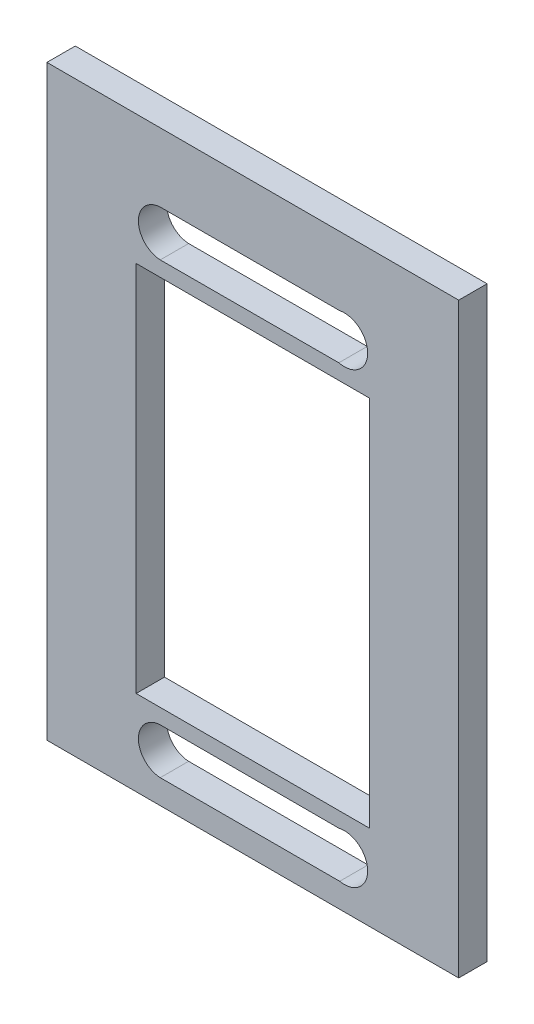
ISO-10303-21;
HEADER;
FILE_DESCRIPTION(('STEP AP214'),'2;1');
FILE_NAME('part.step','',(''),(''),'','','');
FILE_SCHEMA(('AUTOMOTIVE_DESIGN { 1 0 10303 214 1 1 1 1 }'));
ENDSEC;
DATA;
#1=APPLICATION_CONTEXT('core data for automotive mechanical design processes');
#2=APPLICATION_PROTOCOL_DEFINITION('international standard','automotive_design',2000,#1);
#3=PRODUCT_CONTEXT('',#1,'mechanical');
#4=PRODUCT('Part','Part','',(#3));
#5=PRODUCT_RELATED_PRODUCT_CATEGORY('part','',(#4));
#6=PRODUCT_DEFINITION_FORMATION('','',#4);
#7=PRODUCT_DEFINITION_CONTEXT('part definition',#1,'design');
#8=PRODUCT_DEFINITION('design','',#6,#7);
#9=PRODUCT_DEFINITION_SHAPE('','',#8);
#10=(LENGTH_UNIT() NAMED_UNIT(*) SI_UNIT(.MILLI.,.METRE.));
#11=(NAMED_UNIT(*) PLANE_ANGLE_UNIT() SI_UNIT($,.RADIAN.));
#12=(NAMED_UNIT(*) SI_UNIT($,.STERADIAN.) SOLID_ANGLE_UNIT());
#13=UNCERTAINTY_MEASURE_WITH_UNIT(LENGTH_MEASURE(1.E-05),#10,'distance_accuracy_value','');
#14=(GEOMETRIC_REPRESENTATION_CONTEXT(3) GLOBAL_UNCERTAINTY_ASSIGNED_CONTEXT((#13)) GLOBAL_UNIT_ASSIGNED_CONTEXT((#10,
#11,#12)) REPRESENTATION_CONTEXT('',''));
#15=CARTESIAN_POINT('',(0.,0.,0.));
#16=DIRECTION('',(0.,0.,1.));
#17=DIRECTION('',(1.,0.,0.));
#18=AXIS2_PLACEMENT_3D('',#15,#16,#17);
#19=CARTESIAN_POINT('',(0.,0.,3.1));
#20=DIRECTION('',(0.,0.,-1.));
#21=DIRECTION('',(-1.,0.,0.));
#22=AXIS2_PLACEMENT_3D('',#19,#20,#21);
#23=PLANE('',#22);
#24=CARTESIAN_POINT('',(9.99999999999998,14.15,3.1));
#25=DIRECTION('',(0.,0.,1.));
#26=DIRECTION('',(-1.,0.,0.));
#27=AXIS2_PLACEMENT_3D('',#24,#25,#26);
#28=CIRCLE('',#27,2.55083217698693);
#29=CARTESIAN_POINT('',(9.39861156519129,11.6710734690939,3.1));
#30=VERTEX_POINT('',#29);
#31=CARTESIAN_POINT('',(9.493300093594,16.65,3.1));
#32=VERTEX_POINT('',#31);
#33=EDGE_CURVE('E225',#30,#32,#28,.T.);
#34=ORIENTED_EDGE('',*,*,#33,.F.);
#35=DIRECTION('',(0.999999416871496,0.00107993364100275,0.));
#36=VECTOR('',#35,1.);
#37=CARTESIAN_POINT('',(-10.1150474275755,11.65,3.1));
#38=LINE('',#37,#36);
#39=CARTESIAN_POINT('',(-10.1150474275755,11.65,3.1));
#40=VERTEX_POINT('',#39);
#41=EDGE_CURVE('E221',#40,#30,#38,.T.);
#42=ORIENTED_EDGE('',*,*,#41,.F.);
#43=CARTESIAN_POINT('',(-9.99999999999997,14.15,3.1));
#44=DIRECTION('',(0.,0.,1.));
#45=DIRECTION('',(1.,0.,0.));
#46=AXIS2_PLACEMENT_3D('',#43,#44,#45);
#47=CIRCLE('',#46,2.50264578208579);
#48=CARTESIAN_POINT('',(-10.1150474275755,16.65,3.1));
#49=VERTEX_POINT('',#48);
#50=EDGE_CURVE('E237',#49,#40,#47,.T.);
#51=ORIENTED_EDGE('',*,*,#50,.F.);
#52=DIRECTION('',(-1.,0.,0.));
#53=VECTOR('',#52,1.);
#54=CARTESIAN_POINT('',(-10.1150474275755,16.65,3.1));
#55=LINE('',#54,#53);
#56=EDGE_CURVE('E240',#32,#49,#55,.T.);
#57=ORIENTED_EDGE('',*,*,#56,.F.);
#58=EDGE_LOOP('',(#34,#42,#51,#57));
#59=FACE_BOUND('',#58,.T.);
#60=DIRECTION('',(0.,1.,0.));
#61=VECTOR('',#60,1.);
#62=CARTESIAN_POINT('',(22.5,-40.,3.1));
#63=LINE('',#62,#61);
#64=CARTESIAN_POINT('',(22.5,-40.,3.1));
#65=VERTEX_POINT('',#64);
#66=CARTESIAN_POINT('',(22.5,24.15,3.1));
#67=VERTEX_POINT('',#66);
#68=EDGE_CURVE('E176',#65,#67,#63,.T.);
#69=ORIENTED_EDGE('',*,*,#68,.T.);
#70=DIRECTION('',(1.,0.,0.));
#71=VECTOR('',#70,1.);
#72=CARTESIAN_POINT('',(-22.5,24.15,3.1));
#73=LINE('',#72,#71);
#74=CARTESIAN_POINT('',(-22.5,24.15,3.1));
#75=VERTEX_POINT('',#74);
#76=EDGE_CURVE('E146',#75,#67,#73,.T.);
#77=ORIENTED_EDGE('',*,*,#76,.F.);
#78=DIRECTION('',(0.,-1.,0.));
#79=VECTOR('',#78,1.);
#80=CARTESIAN_POINT('',(-22.5,-40.,3.1));
#81=LINE('',#80,#79);
#82=CARTESIAN_POINT('',(-22.5,-40.,3.1));
#83=VERTEX_POINT('',#82);
#84=EDGE_CURVE('E177',#75,#83,#81,.T.);
#85=ORIENTED_EDGE('',*,*,#84,.T.);
#86=DIRECTION('',(1.,0.,0.));
#87=VECTOR('',#86,1.);
#88=CARTESIAN_POINT('',(-22.5,-40.,3.1));
#89=LINE('',#88,#87);
#90=EDGE_CURVE('E173',#83,#65,#89,.T.);
#91=ORIENTED_EDGE('',*,*,#90,.T.);
#92=EDGE_LOOP('',(#69,#77,#85,#91));
#93=FACE_BOUND('',#92,.T.);
#94=DIRECTION('',(0.,1.,0.));
#95=VECTOR('',#94,1.);
#96=CARTESIAN_POINT('',(12.75,-30.7,3.1));
#97=LINE('',#96,#95);
#98=CARTESIAN_POINT('',(12.75,-30.7,3.1));
#99=VERTEX_POINT('',#98);
#100=CARTESIAN_POINT('',(12.75,10.,3.1));
#101=VERTEX_POINT('',#100);
#102=EDGE_CURVE('E194',#99,#101,#97,.T.);
#103=ORIENTED_EDGE('',*,*,#102,.F.);
#104=DIRECTION('',(1.,0.,0.));
#105=VECTOR('',#104,1.);
#106=CARTESIAN_POINT('',(-12.75,-30.7,3.1));
#107=LINE('',#106,#105);
#108=CARTESIAN_POINT('',(-12.75,-30.7,3.1));
#109=VERTEX_POINT('',#108);
#110=EDGE_CURVE('E190',#109,#99,#107,.T.);
#111=ORIENTED_EDGE('',*,*,#110,.F.);
#112=DIRECTION('',(0.,-1.,0.));
#113=VECTOR('',#112,1.);
#114=CARTESIAN_POINT('',(-12.75,-30.7,3.1));
#115=LINE('',#114,#113);
#116=CARTESIAN_POINT('',(-12.75,10.,3.1));
#117=VERTEX_POINT('',#116);
#118=EDGE_CURVE('E206',#117,#109,#115,.T.);
#119=ORIENTED_EDGE('',*,*,#118,.F.);
#120=DIRECTION('',(-1.,0.,0.));
#121=VECTOR('',#120,1.);
#122=CARTESIAN_POINT('',(-12.75,10.,3.1));
#123=LINE('',#122,#121);
#124=EDGE_CURVE('E209',#101,#117,#123,.T.);
#125=ORIENTED_EDGE('',*,*,#124,.F.);
#126=EDGE_LOOP('',(#103,#111,#119,#125));
#127=FACE_BOUND('',#126,.T.);
#128=CARTESIAN_POINT('',(-9.99999999999997,-34.85,3.1));
#129=DIRECTION('',(0.,0.,1.));
#130=DIRECTION('',(-1.,0.,0.));
#131=AXIS2_PLACEMENT_3D('',#128,#129,#130);
#132=CIRCLE('',#131,2.50264578208579);
#133=CARTESIAN_POINT('',(-10.1150474275755,-32.35,3.1));
#134=VERTEX_POINT('',#133);
#135=CARTESIAN_POINT('',(-10.1150474275755,-37.35,3.1));
#136=VERTEX_POINT('',#135);
#137=EDGE_CURVE('E255',#134,#136,#132,.T.);
#138=ORIENTED_EDGE('',*,*,#137,.F.);
#139=DIRECTION('',(-0.999999416871496,0.00107993364100275,0.));
#140=VECTOR('',#139,1.);
#141=CARTESIAN_POINT('',(-10.1150474275755,-32.35,3.1));
#142=LINE('',#141,#140);
#143=CARTESIAN_POINT('',(9.39861156519128,-32.3710734690939,3.1));
#144=VERTEX_POINT('',#143);
#145=EDGE_CURVE('E251',#144,#134,#142,.T.);
#146=ORIENTED_EDGE('',*,*,#145,.F.);
#147=CARTESIAN_POINT('',(10.,-34.85,3.1));
#148=DIRECTION('',(0.,0.,1.));
#149=DIRECTION('',(1.,0.,0.));
#150=AXIS2_PLACEMENT_3D('',#147,#148,#149);
#151=CIRCLE('',#150,2.55083217698694);
#152=CARTESIAN_POINT('',(9.493300093594,-37.35,3.1));
#153=VERTEX_POINT('',#152);
#154=EDGE_CURVE('E265',#153,#144,#151,.T.);
#155=ORIENTED_EDGE('',*,*,#154,.F.);
#156=DIRECTION('',(1.,0.,0.));
#157=VECTOR('',#156,1.);
#158=CARTESIAN_POINT('',(-10.1150474275755,-37.35,3.1));
#159=LINE('',#158,#157);
#160=EDGE_CURVE('E267',#136,#153,#159,.T.);
#161=ORIENTED_EDGE('',*,*,#160,.F.);
#162=EDGE_LOOP('',(#138,#146,#155,#161));
#163=FACE_BOUND('',#162,.T.);
#164=ADVANCED_FACE('F32',(#59,#93,#127,#163),#23,.F.);
#165=CARTESIAN_POINT('',(0.,0.,0.));
#166=DIRECTION('',(0.,0.,-1.));
#167=DIRECTION('',(-1.,0.,0.));
#168=AXIS2_PLACEMENT_3D('',#165,#166,#167);
#169=PLANE('',#168);
#170=DIRECTION('',(1.,0.,0.));
#171=VECTOR('',#170,1.);
#172=CARTESIAN_POINT('',(-22.5,24.15,0.));
#173=LINE('',#172,#171);
#174=CARTESIAN_POINT('',(-22.5,24.15,0.));
#175=VERTEX_POINT('',#174);
#176=CARTESIAN_POINT('',(22.5,24.15,0.));
#177=VERTEX_POINT('',#176);
#178=EDGE_CURVE('E47',#175,#177,#173,.T.);
#179=ORIENTED_EDGE('',*,*,#178,.T.);
#180=DIRECTION('',(0.,1.,0.));
#181=VECTOR('',#180,1.);
#182=CARTESIAN_POINT('',(22.5,-40.,0.));
#183=LINE('',#182,#181);
#184=CARTESIAN_POINT('',(22.5,-40.,0.));
#185=VERTEX_POINT('',#184);
#186=EDGE_CURVE('E160',#185,#177,#183,.T.);
#187=ORIENTED_EDGE('',*,*,#186,.F.);
#188=DIRECTION('',(1.,0.,0.));
#189=VECTOR('',#188,1.);
#190=CARTESIAN_POINT('',(-22.5,-40.,0.));
#191=LINE('',#190,#189);
#192=CARTESIAN_POINT('',(-22.5,-40.,0.));
#193=VERTEX_POINT('',#192);
#194=EDGE_CURVE('E167',#193,#185,#191,.T.);
#195=ORIENTED_EDGE('',*,*,#194,.F.);
#196=DIRECTION('',(0.,-1.,0.));
#197=VECTOR('',#196,1.);
#198=CARTESIAN_POINT('',(-22.5,-40.,0.));
#199=LINE('',#198,#197);
#200=EDGE_CURVE('E161',#175,#193,#199,.T.);
#201=ORIENTED_EDGE('',*,*,#200,.F.);
#202=EDGE_LOOP('',(#179,#187,#195,#201));
#203=FACE_BOUND('',#202,.T.);
#204=DIRECTION('',(0.999999416871496,0.00107993364100275,0.));
#205=VECTOR('',#204,1.);
#206=CARTESIAN_POINT('',(-10.1150474275755,11.65,0.));
#207=LINE('',#206,#205);
#208=CARTESIAN_POINT('',(-10.1150474275755,11.65,0.));
#209=VERTEX_POINT('',#208);
#210=CARTESIAN_POINT('',(9.39861156519129,11.6710734690939,0.));
#211=VERTEX_POINT('',#210);
#212=EDGE_CURVE('E222',#209,#211,#207,.T.);
#213=ORIENTED_EDGE('',*,*,#212,.T.);
#214=CARTESIAN_POINT('',(9.99999999999998,14.15,0.));
#215=DIRECTION('',(0.,0.,1.));
#216=DIRECTION('',(-1.,0.,0.));
#217=AXIS2_PLACEMENT_3D('',#214,#215,#216);
#218=CIRCLE('',#217,2.55083217698693);
#219=CARTESIAN_POINT('',(9.493300093594,16.65,0.));
#220=VERTEX_POINT('',#219);
#221=EDGE_CURVE('E232',#211,#220,#218,.T.);
#222=ORIENTED_EDGE('',*,*,#221,.T.);
#223=DIRECTION('',(-1.,0.,0.));
#224=VECTOR('',#223,1.);
#225=CARTESIAN_POINT('',(-10.1150474275755,16.65,0.));
#226=LINE('',#225,#224);
#227=CARTESIAN_POINT('',(-10.1150474275755,16.65,0.));
#228=VERTEX_POINT('',#227);
#229=EDGE_CURVE('E229',#220,#228,#226,.T.);
#230=ORIENTED_EDGE('',*,*,#229,.T.);
#231=CARTESIAN_POINT('',(-9.99999999999997,14.15,0.));
#232=DIRECTION('',(0.,0.,1.));
#233=DIRECTION('',(1.,0.,0.));
#234=AXIS2_PLACEMENT_3D('',#231,#232,#233);
#235=CIRCLE('',#234,2.50264578208579);
#236=EDGE_CURVE('E226',#228,#209,#235,.T.);
#237=ORIENTED_EDGE('',*,*,#236,.T.);
#238=EDGE_LOOP('',(#213,#222,#230,#237));
#239=FACE_BOUND('',#238,.T.);
#240=DIRECTION('',(1.,0.,0.));
#241=VECTOR('',#240,1.);
#242=CARTESIAN_POINT('',(-12.75,-30.7,0.));
#243=LINE('',#242,#241);
#244=CARTESIAN_POINT('',(-12.75,-30.7,0.));
#245=VERTEX_POINT('',#244);
#246=CARTESIAN_POINT('',(12.75,-30.7,0.));
#247=VERTEX_POINT('',#246);
#248=EDGE_CURVE('E191',#245,#247,#243,.T.);
#249=ORIENTED_EDGE('',*,*,#248,.T.);
#250=DIRECTION('',(0.,1.,0.));
#251=VECTOR('',#250,1.);
#252=CARTESIAN_POINT('',(12.75,-30.7,0.));
#253=LINE('',#252,#251);
#254=CARTESIAN_POINT('',(12.75,10.,0.));
#255=VERTEX_POINT('',#254);
#256=EDGE_CURVE('E201',#247,#255,#253,.T.);
#257=ORIENTED_EDGE('',*,*,#256,.T.);
#258=DIRECTION('',(-1.,0.,0.));
#259=VECTOR('',#258,1.);
#260=CARTESIAN_POINT('',(-12.75,10.,0.));
#261=LINE('',#260,#259);
#262=CARTESIAN_POINT('',(-12.75,10.,0.));
#263=VERTEX_POINT('',#262);
#264=EDGE_CURVE('E198',#255,#263,#261,.T.);
#265=ORIENTED_EDGE('',*,*,#264,.T.);
#266=DIRECTION('',(0.,-1.,0.));
#267=VECTOR('',#266,1.);
#268=CARTESIAN_POINT('',(-12.75,-30.7,0.));
#269=LINE('',#268,#267);
#270=EDGE_CURVE('E195',#263,#245,#269,.T.);
#271=ORIENTED_EDGE('',*,*,#270,.T.);
#272=EDGE_LOOP('',(#249,#257,#265,#271));
#273=FACE_BOUND('',#272,.T.);
#274=DIRECTION('',(-0.999999416871496,0.00107993364100275,0.));
#275=VECTOR('',#274,1.);
#276=CARTESIAN_POINT('',(-10.1150474275755,-32.35,0.));
#277=LINE('',#276,#275);
#278=CARTESIAN_POINT('',(9.39861156519128,-32.3710734690939,0.));
#279=VERTEX_POINT('',#278);
#280=CARTESIAN_POINT('',(-10.1150474275755,-32.35,0.));
#281=VERTEX_POINT('',#280);
#282=EDGE_CURVE('E252',#279,#281,#277,.T.);
#283=ORIENTED_EDGE('',*,*,#282,.T.);
#284=CARTESIAN_POINT('',(-9.99999999999997,-34.85,0.));
#285=DIRECTION('',(0.,0.,1.));
#286=DIRECTION('',(-1.,0.,0.));
#287=AXIS2_PLACEMENT_3D('',#284,#285,#286);
#288=CIRCLE('',#287,2.50264578208579);
#289=CARTESIAN_POINT('',(-10.1150474275755,-37.35,0.));
#290=VERTEX_POINT('',#289);
#291=EDGE_CURVE('E151',#281,#290,#288,.T.);
#292=ORIENTED_EDGE('',*,*,#291,.T.);
#293=DIRECTION('',(1.,0.,0.));
#294=VECTOR('',#293,1.);
#295=CARTESIAN_POINT('',(-10.1150474275755,-37.35,0.));
#296=LINE('',#295,#294);
#297=CARTESIAN_POINT('',(9.493300093594,-37.35,0.));
#298=VERTEX_POINT('',#297);
#299=EDGE_CURVE('E259',#290,#298,#296,.T.);
#300=ORIENTED_EDGE('',*,*,#299,.T.);
#301=CARTESIAN_POINT('',(10.,-34.85,0.));
#302=DIRECTION('',(0.,0.,1.));
#303=DIRECTION('',(1.,0.,0.));
#304=AXIS2_PLACEMENT_3D('',#301,#302,#303);
#305=CIRCLE('',#304,2.55083217698694);
#306=EDGE_CURVE('E256',#298,#279,#305,.T.);
#307=ORIENTED_EDGE('',*,*,#306,.T.);
#308=EDGE_LOOP('',(#283,#292,#300,#307));
#309=FACE_BOUND('',#308,.T.);
#310=ADVANCED_FACE('F157',(#203,#239,#273,#309),#169,.T.);
#311=CARTESIAN_POINT('',(22.5,-40.,3.1));
#312=DIRECTION('',(-1.,0.,0.));
#313=DIRECTION('',(0.,-1.,0.));
#314=AXIS2_PLACEMENT_3D('',#311,#312,#313);
#315=PLANE('',#314);
#316=ORIENTED_EDGE('',*,*,#186,.T.);
#317=DIRECTION('',(0.,0.,1.));
#318=VECTOR('',#317,1.);
#319=CARTESIAN_POINT('',(22.5,24.15,0.));
#320=LINE('',#319,#318);
#321=EDGE_CURVE('E143',#177,#67,#320,.T.);
#322=ORIENTED_EDGE('',*,*,#321,.T.);
#323=ORIENTED_EDGE('',*,*,#68,.F.);
#324=DIRECTION('',(0.,0.,-1.));
#325=VECTOR('',#324,1.);
#326=CARTESIAN_POINT('',(22.5,-40.,3.1));
#327=LINE('',#326,#325);
#328=EDGE_CURVE('E40',#65,#185,#327,.T.);
#329=ORIENTED_EDGE('',*,*,#328,.T.);
#330=EDGE_LOOP('',(#316,#322,#323,#329));
#331=FACE_BOUND('',#330,.T.);
#332=ADVANCED_FACE('F34',(#331),#315,.F.);
#333=CARTESIAN_POINT('',(-22.5,-40.,3.1));
#334=DIRECTION('',(1.,0.,0.));
#335=DIRECTION('',(0.,0.,-1.));
#336=AXIS2_PLACEMENT_3D('',#333,#334,#335);
#337=PLANE('',#336);
#338=ORIENTED_EDGE('',*,*,#84,.F.);
#339=DIRECTION('',(0.,0.,1.));
#340=VECTOR('',#339,1.);
#341=CARTESIAN_POINT('',(-22.5,24.15,0.));
#342=LINE('',#341,#340);
#343=EDGE_CURVE('E152',#175,#75,#342,.T.);
#344=ORIENTED_EDGE('',*,*,#343,.F.);
#345=ORIENTED_EDGE('',*,*,#200,.T.);
#346=DIRECTION('',(0.,0.,-1.));
#347=VECTOR('',#346,1.);
#348=CARTESIAN_POINT('',(-22.5,-40.,3.1));
#349=LINE('',#348,#347);
#350=EDGE_CURVE('E11',#83,#193,#349,.T.);
#351=ORIENTED_EDGE('',*,*,#350,.F.);
#352=EDGE_LOOP('',(#338,#344,#345,#351));
#353=FACE_BOUND('',#352,.T.);
#354=ADVANCED_FACE('F273',(#353),#337,.F.);
#355=CARTESIAN_POINT('',(-22.5,-40.,3.1));
#356=DIRECTION('',(0.,1.,0.));
#357=DIRECTION('',(-1.,0.,0.));
#358=AXIS2_PLACEMENT_3D('',#355,#356,#357);
#359=PLANE('',#358);
#360=ORIENTED_EDGE('',*,*,#194,.T.);
#361=ORIENTED_EDGE('',*,*,#328,.F.);
#362=ORIENTED_EDGE('',*,*,#90,.F.);
#363=ORIENTED_EDGE('',*,*,#350,.T.);
#364=EDGE_LOOP('',(#360,#361,#362,#363));
#365=FACE_BOUND('',#364,.T.);
#366=ADVANCED_FACE('F275',(#365),#359,.F.);
#367=CARTESIAN_POINT('',(12.75,-30.7,3.1));
#368=DIRECTION('',(-1.,0.,0.));
#369=DIRECTION('',(0.,0.,1.));
#370=AXIS2_PLACEMENT_3D('',#367,#368,#369);
#371=PLANE('',#370);
#372=ORIENTED_EDGE('',*,*,#256,.F.);
#373=DIRECTION('',(0.,0.,-1.));
#374=VECTOR('',#373,1.);
#375=CARTESIAN_POINT('',(12.75,-30.7,3.1));
#376=LINE('',#375,#374);
#377=EDGE_CURVE('E187',#99,#247,#376,.T.);
#378=ORIENTED_EDGE('',*,*,#377,.F.);
#379=ORIENTED_EDGE('',*,*,#102,.T.);
#380=DIRECTION('',(0.,0.,-1.));
#381=VECTOR('',#380,1.);
#382=CARTESIAN_POINT('',(12.75,10.,3.1));
#383=LINE('',#382,#381);
#384=EDGE_CURVE('E165',#101,#255,#383,.T.);
#385=ORIENTED_EDGE('',*,*,#384,.T.);
#386=EDGE_LOOP('',(#372,#378,#379,#385));
#387=FACE_BOUND('',#386,.T.);
#388=ADVANCED_FACE('F277',(#387),#371,.T.);
#389=CARTESIAN_POINT('',(-12.75,10.,3.1));
#390=DIRECTION('',(0.,-1.,0.));
#391=DIRECTION('',(0.,0.,-1.));
#392=AXIS2_PLACEMENT_3D('',#389,#390,#391);
#393=PLANE('',#392);
#394=ORIENTED_EDGE('',*,*,#264,.F.);
#395=ORIENTED_EDGE('',*,*,#384,.F.);
#396=ORIENTED_EDGE('',*,*,#124,.T.);
#397=DIRECTION('',(0.,0.,-1.));
#398=VECTOR('',#397,1.);
#399=CARTESIAN_POINT('',(-12.75,10.,3.1));
#400=LINE('',#399,#398);
#401=EDGE_CURVE('E170',#117,#263,#400,.T.);
#402=ORIENTED_EDGE('',*,*,#401,.T.);
#403=EDGE_LOOP('',(#394,#395,#396,#402));
#404=FACE_BOUND('',#403,.T.);
#405=ADVANCED_FACE('F283',(#404),#393,.T.);
#406=CARTESIAN_POINT('',(-12.75,-30.7,3.1));
#407=DIRECTION('',(1.,0.,0.));
#408=DIRECTION('',(0.,0.,-1.));
#409=AXIS2_PLACEMENT_3D('',#406,#407,#408);
#410=PLANE('',#409);
#411=ORIENTED_EDGE('',*,*,#270,.F.);
#412=ORIENTED_EDGE('',*,*,#401,.F.);
#413=ORIENTED_EDGE('',*,*,#118,.T.);
#414=DIRECTION('',(0.,0.,-1.));
#415=VECTOR('',#414,1.);
#416=CARTESIAN_POINT('',(-12.75,-30.7,3.1));
#417=LINE('',#416,#415);
#418=EDGE_CURVE('E185',#109,#245,#417,.T.);
#419=ORIENTED_EDGE('',*,*,#418,.T.);
#420=EDGE_LOOP('',(#411,#412,#413,#419));
#421=FACE_BOUND('',#420,.T.);
#422=ADVANCED_FACE('F297',(#421),#410,.T.);
#423=CARTESIAN_POINT('',(-12.75,-30.7,3.1));
#424=DIRECTION('',(0.,1.,0.));
#425=DIRECTION('',(0.,0.,1.));
#426=AXIS2_PLACEMENT_3D('',#423,#424,#425);
#427=PLANE('',#426);
#428=ORIENTED_EDGE('',*,*,#248,.F.);
#429=ORIENTED_EDGE('',*,*,#418,.F.);
#430=ORIENTED_EDGE('',*,*,#110,.T.);
#431=ORIENTED_EDGE('',*,*,#377,.T.);
#432=EDGE_LOOP('',(#428,#429,#430,#431));
#433=FACE_BOUND('',#432,.T.);
#434=ADVANCED_FACE('F301',(#433),#427,.T.);
#435=CARTESIAN_POINT('',(9.99999999999998,14.15,3.1));
#436=DIRECTION('',(0.,0.,-1.));
#437=DIRECTION('',(-1.,0.,0.));
#438=AXIS2_PLACEMENT_3D('',#435,#436,#437);
#439=CYLINDRICAL_SURFACE('',#438,2.55083217698693);
#440=ORIENTED_EDGE('',*,*,#221,.F.);
#441=DIRECTION('',(0.,0.,-1.));
#442=VECTOR('',#441,1.);
#443=CARTESIAN_POINT('',(9.39861156519129,11.6710734690939,3.1));
#444=LINE('',#443,#442);
#445=EDGE_CURVE('E218',#30,#211,#444,.T.);
#446=ORIENTED_EDGE('',*,*,#445,.F.);
#447=ORIENTED_EDGE('',*,*,#33,.T.);
#448=DIRECTION('',(0.,0.,-1.));
#449=VECTOR('',#448,1.);
#450=CARTESIAN_POINT('',(9.493300093594,16.65,3.1));
#451=LINE('',#450,#449);
#452=EDGE_CURVE('E204',#32,#220,#451,.T.);
#453=ORIENTED_EDGE('',*,*,#452,.T.);
#454=EDGE_LOOP('',(#440,#446,#447,#453));
#455=FACE_BOUND('',#454,.T.);
#456=ADVANCED_FACE('F305',(#455),#439,.F.);
#457=CARTESIAN_POINT('',(-10.1150474275755,16.65,3.1));
#458=DIRECTION('',(0.,-1.,0.));
#459=DIRECTION('',(0.,0.,-1.));
#460=AXIS2_PLACEMENT_3D('',#457,#458,#459);
#461=PLANE('',#460);
#462=ORIENTED_EDGE('',*,*,#229,.F.);
#463=ORIENTED_EDGE('',*,*,#452,.F.);
#464=ORIENTED_EDGE('',*,*,#56,.T.);
#465=DIRECTION('',(0.,0.,-1.));
#466=VECTOR('',#465,1.);
#467=CARTESIAN_POINT('',(-10.1150474275755,16.65,3.1));
#468=LINE('',#467,#466);
#469=EDGE_CURVE('E214',#49,#228,#468,.T.);
#470=ORIENTED_EDGE('',*,*,#469,.T.);
#471=EDGE_LOOP('',(#462,#463,#464,#470));
#472=FACE_BOUND('',#471,.T.);
#473=ADVANCED_FACE('F309',(#472),#461,.T.);
#474=CARTESIAN_POINT('',(-9.99999999999997,14.15,3.1));
#475=DIRECTION('',(0.,0.,-1.));
#476=DIRECTION('',(-1.,0.,0.));
#477=AXIS2_PLACEMENT_3D('',#474,#475,#476);
#478=CYLINDRICAL_SURFACE('',#477,2.50264578208579);
#479=ORIENTED_EDGE('',*,*,#236,.F.);
#480=ORIENTED_EDGE('',*,*,#469,.F.);
#481=ORIENTED_EDGE('',*,*,#50,.T.);
#482=DIRECTION('',(0.,0.,-1.));
#483=VECTOR('',#482,1.);
#484=CARTESIAN_POINT('',(-10.1150474275755,11.65,3.1));
#485=LINE('',#484,#483);
#486=EDGE_CURVE('E216',#40,#209,#485,.T.);
#487=ORIENTED_EDGE('',*,*,#486,.T.);
#488=EDGE_LOOP('',(#479,#480,#481,#487));
#489=FACE_BOUND('',#488,.T.);
#490=ADVANCED_FACE('F313',(#489),#478,.F.);
#491=CARTESIAN_POINT('',(-10.1150474275755,11.65,3.1));
#492=DIRECTION('',(-0.00107993364100275,0.999999416871495,0.));
#493=DIRECTION('',(-0.999999416871496,-0.00107993364100275,0.));
#494=AXIS2_PLACEMENT_3D('',#491,#492,#493);
#495=PLANE('',#494);
#496=ORIENTED_EDGE('',*,*,#212,.F.);
#497=ORIENTED_EDGE('',*,*,#486,.F.);
#498=ORIENTED_EDGE('',*,*,#41,.T.);
#499=ORIENTED_EDGE('',*,*,#445,.T.);
#500=EDGE_LOOP('',(#496,#497,#498,#499));
#501=FACE_BOUND('',#500,.T.);
#502=ADVANCED_FACE('F317',(#501),#495,.T.);
#503=CARTESIAN_POINT('',(-9.99999999999997,-34.85,3.1));
#504=DIRECTION('',(0.,0.,-1.));
#505=DIRECTION('',(-1.,0.,0.));
#506=AXIS2_PLACEMENT_3D('',#503,#504,#505);
#507=CYLINDRICAL_SURFACE('',#506,2.50264578208579);
#508=ORIENTED_EDGE('',*,*,#291,.F.);
#509=DIRECTION('',(0.,0.,-1.));
#510=VECTOR('',#509,1.);
#511=CARTESIAN_POINT('',(-10.1150474275755,-32.35,3.1));
#512=LINE('',#511,#510);
#513=EDGE_CURVE('E248',#134,#281,#512,.T.);
#514=ORIENTED_EDGE('',*,*,#513,.F.);
#515=ORIENTED_EDGE('',*,*,#137,.T.);
#516=DIRECTION('',(0.,0.,-1.));
#517=VECTOR('',#516,1.);
#518=CARTESIAN_POINT('',(-10.1150474275755,-37.35,3.1));
#519=LINE('',#518,#517);
#520=EDGE_CURVE('E235',#136,#290,#519,.T.);
#521=ORIENTED_EDGE('',*,*,#520,.T.);
#522=EDGE_LOOP('',(#508,#514,#515,#521));
#523=FACE_BOUND('',#522,.T.);
#524=ADVANCED_FACE('F321',(#523),#507,.F.);
#525=CARTESIAN_POINT('',(-10.1150474275755,-37.35,3.1));
#526=DIRECTION('',(0.,1.,0.));
#527=DIRECTION('',(0.,0.,1.));
#528=AXIS2_PLACEMENT_3D('',#525,#526,#527);
#529=PLANE('',#528);
#530=ORIENTED_EDGE('',*,*,#299,.F.);
#531=ORIENTED_EDGE('',*,*,#520,.F.);
#532=ORIENTED_EDGE('',*,*,#160,.T.);
#533=DIRECTION('',(0.,0.,-1.));
#534=VECTOR('',#533,1.);
#535=CARTESIAN_POINT('',(9.493300093594,-37.35,3.1));
#536=LINE('',#535,#534);
#537=EDGE_CURVE('E245',#153,#298,#536,.T.);
#538=ORIENTED_EDGE('',*,*,#537,.T.);
#539=EDGE_LOOP('',(#530,#531,#532,#538));
#540=FACE_BOUND('',#539,.T.);
#541=ADVANCED_FACE('F325',(#540),#529,.T.);
#542=CARTESIAN_POINT('',(10.,-34.85,3.1));
#543=DIRECTION('',(0.,0.,-1.));
#544=DIRECTION('',(-1.,0.,0.));
#545=AXIS2_PLACEMENT_3D('',#542,#543,#544);
#546=CYLINDRICAL_SURFACE('',#545,2.55083217698694);
#547=ORIENTED_EDGE('',*,*,#306,.F.);
#548=ORIENTED_EDGE('',*,*,#537,.F.);
#549=ORIENTED_EDGE('',*,*,#154,.T.);
#550=DIRECTION('',(0.,0.,-1.));
#551=VECTOR('',#550,1.);
#552=CARTESIAN_POINT('',(9.39861156519128,-32.3710734690939,3.1));
#553=LINE('',#552,#551);
#554=EDGE_CURVE('E55',#144,#279,#553,.T.);
#555=ORIENTED_EDGE('',*,*,#554,.T.);
#556=EDGE_LOOP('',(#547,#548,#549,#555));
#557=FACE_BOUND('',#556,.T.);
#558=ADVANCED_FACE('F329',(#557),#546,.F.);
#559=CARTESIAN_POINT('',(-10.1150474275755,-32.35,3.1));
#560=DIRECTION('',(-0.00107993364100275,-0.999999416871495,0.));
#561=DIRECTION('',(0.999999416871496,-0.00107993364100275,0.));
#562=AXIS2_PLACEMENT_3D('',#559,#560,#561);
#563=PLANE('',#562);
#564=ORIENTED_EDGE('',*,*,#282,.F.);
#565=ORIENTED_EDGE('',*,*,#554,.F.);
#566=ORIENTED_EDGE('',*,*,#145,.T.);
#567=ORIENTED_EDGE('',*,*,#513,.T.);
#568=EDGE_LOOP('',(#564,#565,#566,#567));
#569=FACE_BOUND('',#568,.T.);
#570=ADVANCED_FACE('F333',(#569),#563,.T.);
#571=CARTESIAN_POINT('',(-22.5,24.15,0.));
#572=DIRECTION('',(0.,-1.,0.));
#573=DIRECTION('',(0.,0.,-1.));
#574=AXIS2_PLACEMENT_3D('',#571,#572,#573);
#575=PLANE('',#574);
#576=ORIENTED_EDGE('',*,*,#76,.T.);
#577=ORIENTED_EDGE('',*,*,#321,.F.);
#578=ORIENTED_EDGE('',*,*,#178,.F.);
#579=ORIENTED_EDGE('',*,*,#343,.T.);
#580=EDGE_LOOP('',(#576,#577,#578,#579));
#581=FACE_BOUND('',#580,.T.);
#582=ADVANCED_FACE('F144',(#581),#575,.F.);
#583=CLOSED_SHELL('',(#164,#310,#332,#354,#366,#388,#405,#422,#434,#456,#473,#490,#502,#524,
#541,#558,#570,#582));
#584=MANIFOLD_SOLID_BREP('B2',#583);
#585=ADVANCED_BREP_SHAPE_REPRESENTATION('',(#18,#584),#14);
#586=SHAPE_DEFINITION_REPRESENTATION(#9,#585);
ENDSEC;
END-ISO-10303-21;
